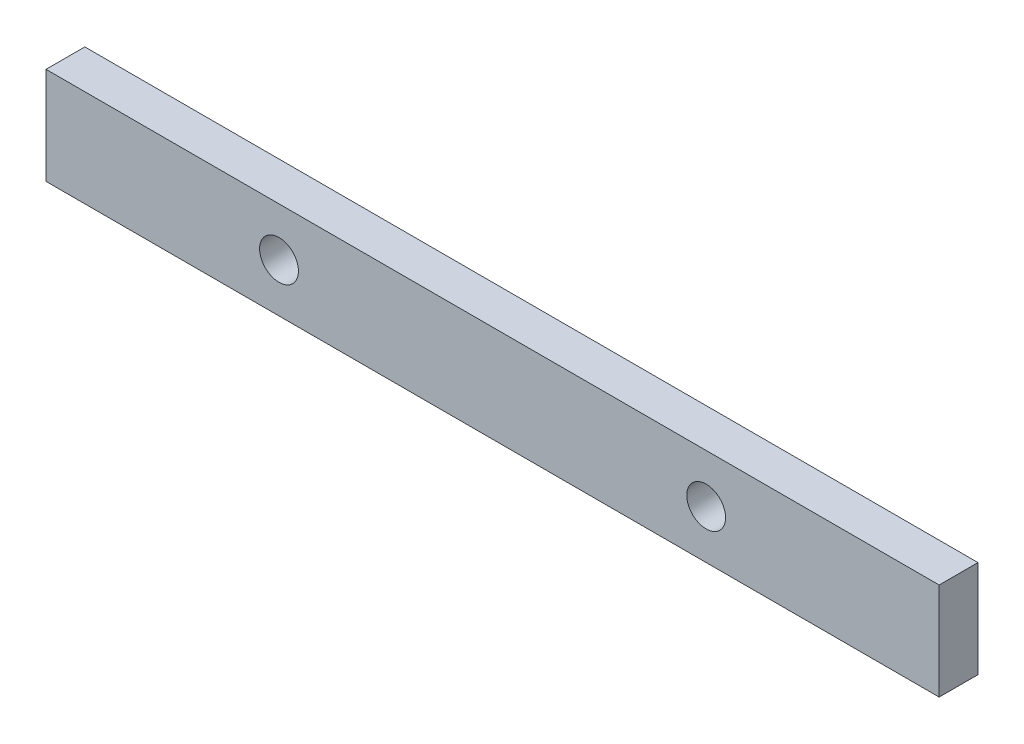
ISO-10303-21;
HEADER;
FILE_DESCRIPTION(('STEP AP214'),'2;1');
FILE_NAME('part.step','',(''),(''),'','','');
FILE_SCHEMA(('AUTOMOTIVE_DESIGN { 1 0 10303 214 1 1 1 1 }'));
ENDSEC;
DATA;
#1=APPLICATION_CONTEXT('core data for automotive mechanical design processes');
#2=APPLICATION_PROTOCOL_DEFINITION('international standard','automotive_design',2000,#1);
#3=PRODUCT_CONTEXT('',#1,'mechanical');
#4=PRODUCT('Part','Part','',(#3));
#5=PRODUCT_RELATED_PRODUCT_CATEGORY('part','',(#4));
#6=PRODUCT_DEFINITION_FORMATION('','',#4);
#7=PRODUCT_DEFINITION_CONTEXT('part definition',#1,'design');
#8=PRODUCT_DEFINITION('design','',#6,#7);
#9=PRODUCT_DEFINITION_SHAPE('','',#8);
#10=(LENGTH_UNIT() NAMED_UNIT(*) SI_UNIT(.MILLI.,.METRE.));
#11=(NAMED_UNIT(*) PLANE_ANGLE_UNIT() SI_UNIT($,.RADIAN.));
#12=(NAMED_UNIT(*) SI_UNIT($,.STERADIAN.) SOLID_ANGLE_UNIT());
#13=UNCERTAINTY_MEASURE_WITH_UNIT(LENGTH_MEASURE(1.E-05),#10,'distance_accuracy_value','');
#14=(GEOMETRIC_REPRESENTATION_CONTEXT(3) GLOBAL_UNCERTAINTY_ASSIGNED_CONTEXT((#13)) GLOBAL_UNIT_ASSIGNED_CONTEXT((#10,
#11,#12)) REPRESENTATION_CONTEXT('',''));
#15=CARTESIAN_POINT('',(0.,0.,0.));
#16=DIRECTION('',(0.,0.,1.));
#17=DIRECTION('',(1.,0.,0.));
#18=AXIS2_PLACEMENT_3D('',#15,#16,#17);
#19=CARTESIAN_POINT('',(0.,0.,20.));
#20=DIRECTION('',(0.,0.,1.));
#21=DIRECTION('',(1.,0.,0.));
#22=AXIS2_PLACEMENT_3D('',#19,#20,#21);
#23=PLANE('',#22);
#24=CARTESIAN_POINT('',(110.,0.,20.));
#25=DIRECTION('',(0.,0.,1.));
#26=DIRECTION('',(1.,0.,0.));
#27=AXIS2_PLACEMENT_3D('',#24,#25,#26);
#28=CIRCLE('',#27,9.99999999999999);
#29=CARTESIAN_POINT('',(120.,0.,20.));
#30=VERTEX_POINT('',#29);
#31=EDGE_CURVE('E112',#30,#30,#28,.T.);
#32=ORIENTED_EDGE('',*,*,#31,.F.);
#33=EDGE_LOOP('',(#32));
#34=FACE_BOUND('',#33,.T.);
#35=DIRECTION('',(0.,1.,0.));
#36=VECTOR('',#35,1.);
#37=CARTESIAN_POINT('',(230.,25.,20.));
#38=LINE('',#37,#36);
#39=CARTESIAN_POINT('',(230.,-25.,20.));
#40=VERTEX_POINT('',#39);
#41=CARTESIAN_POINT('',(230.,25.,20.));
#42=VERTEX_POINT('',#41);
#43=EDGE_CURVE('E92',#40,#42,#38,.T.);
#44=ORIENTED_EDGE('',*,*,#43,.T.);
#45=DIRECTION('',(-1.,0.,0.));
#46=VECTOR('',#45,1.);
#47=CARTESIAN_POINT('',(-230.,25.,20.));
#48=LINE('',#47,#46);
#49=CARTESIAN_POINT('',(-230.,25.,20.));
#50=VERTEX_POINT('',#49);
#51=EDGE_CURVE('E87',#42,#50,#48,.T.);
#52=ORIENTED_EDGE('',*,*,#51,.T.);
#53=DIRECTION('',(0.,-1.,0.));
#54=VECTOR('',#53,1.);
#55=CARTESIAN_POINT('',(-230.,25.,20.));
#56=LINE('',#55,#54);
#57=CARTESIAN_POINT('',(-230.,-25.,20.));
#58=VERTEX_POINT('',#57);
#59=EDGE_CURVE('E90',#50,#58,#56,.T.);
#60=ORIENTED_EDGE('',*,*,#59,.T.);
#61=DIRECTION('',(1.,0.,0.));
#62=VECTOR('',#61,1.);
#63=CARTESIAN_POINT('',(-230.,-25.,20.));
#64=LINE('',#63,#62);
#65=EDGE_CURVE('E57',#58,#40,#64,.T.);
#66=ORIENTED_EDGE('',*,*,#65,.T.);
#67=EDGE_LOOP('',(#44,#52,#60,#66));
#68=FACE_BOUND('',#67,.T.);
#69=CARTESIAN_POINT('',(-110.,0.,20.));
#70=DIRECTION('',(0.,0.,1.));
#71=DIRECTION('',(1.,0.,0.));
#72=AXIS2_PLACEMENT_3D('',#69,#70,#71);
#73=CIRCLE('',#72,9.99999999999999);
#74=CARTESIAN_POINT('',(-100.,0.,20.));
#75=VERTEX_POINT('',#74);
#76=EDGE_CURVE('E134',#75,#75,#73,.T.);
#77=ORIENTED_EDGE('',*,*,#76,.F.);
#78=EDGE_LOOP('',(#77));
#79=FACE_BOUND('',#78,.T.);
#80=ADVANCED_FACE('F39',(#34,#68,#79),#23,.T.);
#81=CARTESIAN_POINT('',(0.,0.,0.));
#82=DIRECTION('',(0.,0.,1.));
#83=DIRECTION('',(1.,0.,0.));
#84=AXIS2_PLACEMENT_3D('',#81,#82,#83);
#85=PLANE('',#84);
#86=DIRECTION('',(0.,1.,0.));
#87=VECTOR('',#86,1.);
#88=CARTESIAN_POINT('',(230.,25.,0.));
#89=LINE('',#88,#87);
#90=CARTESIAN_POINT('',(230.,-25.,0.));
#91=VERTEX_POINT('',#90);
#92=CARTESIAN_POINT('',(230.,25.,0.));
#93=VERTEX_POINT('',#92);
#94=EDGE_CURVE('E108',#91,#93,#89,.T.);
#95=ORIENTED_EDGE('',*,*,#94,.F.);
#96=DIRECTION('',(1.,0.,0.));
#97=VECTOR('',#96,1.);
#98=CARTESIAN_POINT('',(-230.,-25.,0.));
#99=LINE('',#98,#97);
#100=CARTESIAN_POINT('',(-230.,-25.,0.));
#101=VERTEX_POINT('',#100);
#102=EDGE_CURVE('E80',#101,#91,#99,.T.);
#103=ORIENTED_EDGE('',*,*,#102,.F.);
#104=DIRECTION('',(0.,-1.,0.));
#105=VECTOR('',#104,1.);
#106=CARTESIAN_POINT('',(-230.,25.,0.));
#107=LINE('',#106,#105);
#108=CARTESIAN_POINT('',(-230.,25.,0.));
#109=VERTEX_POINT('',#108);
#110=EDGE_CURVE('E74',#109,#101,#107,.T.);
#111=ORIENTED_EDGE('',*,*,#110,.F.);
#112=DIRECTION('',(-1.,0.,0.));
#113=VECTOR('',#112,1.);
#114=CARTESIAN_POINT('',(-230.,25.,0.));
#115=LINE('',#114,#113);
#116=EDGE_CURVE('E97',#93,#109,#115,.T.);
#117=ORIENTED_EDGE('',*,*,#116,.F.);
#118=EDGE_LOOP('',(#95,#103,#111,#117));
#119=FACE_BOUND('',#118,.T.);
#120=CARTESIAN_POINT('',(110.,0.,0.));
#121=DIRECTION('',(0.,0.,1.));
#122=DIRECTION('',(1.,0.,0.));
#123=AXIS2_PLACEMENT_3D('',#120,#121,#122);
#124=CIRCLE('',#123,9.99999999999999);
#125=CARTESIAN_POINT('',(120.,0.,0.));
#126=VERTEX_POINT('',#125);
#127=EDGE_CURVE('E130',#126,#126,#124,.T.);
#128=ORIENTED_EDGE('',*,*,#127,.T.);
#129=EDGE_LOOP('',(#128));
#130=FACE_BOUND('',#129,.T.);
#131=CARTESIAN_POINT('',(-110.,0.,0.));
#132=DIRECTION('',(0.,0.,1.));
#133=DIRECTION('',(1.,0.,0.));
#134=AXIS2_PLACEMENT_3D('',#131,#132,#133);
#135=CIRCLE('',#134,9.99999999999999);
#136=CARTESIAN_POINT('',(-100.,0.,0.));
#137=VERTEX_POINT('',#136);
#138=EDGE_CURVE('E138',#137,#137,#135,.T.);
#139=ORIENTED_EDGE('',*,*,#138,.T.);
#140=EDGE_LOOP('',(#139));
#141=FACE_BOUND('',#140,.T.);
#142=ADVANCED_FACE('F125',(#119,#130,#141),#85,.F.);
#143=CARTESIAN_POINT('',(230.,25.,20.));
#144=DIRECTION('',(-1.,0.,0.));
#145=DIRECTION('',(0.,0.,1.));
#146=AXIS2_PLACEMENT_3D('',#143,#144,#145);
#147=PLANE('',#146);
#148=ORIENTED_EDGE('',*,*,#94,.T.);
#149=DIRECTION('',(0.,0.,-1.));
#150=VECTOR('',#149,1.);
#151=CARTESIAN_POINT('',(230.,25.,20.));
#152=LINE('',#151,#150);
#153=EDGE_CURVE('E11',#42,#93,#152,.T.);
#154=ORIENTED_EDGE('',*,*,#153,.F.);
#155=ORIENTED_EDGE('',*,*,#43,.F.);
#156=DIRECTION('',(0.,0.,-1.));
#157=VECTOR('',#156,1.);
#158=CARTESIAN_POINT('',(230.,-25.,20.));
#159=LINE('',#158,#157);
#160=EDGE_CURVE('E104',#40,#91,#159,.T.);
#161=ORIENTED_EDGE('',*,*,#160,.T.);
#162=EDGE_LOOP('',(#148,#154,#155,#161));
#163=FACE_BOUND('',#162,.T.);
#164=ADVANCED_FACE('F41',(#163),#147,.F.);
#165=CARTESIAN_POINT('',(-230.,25.,20.));
#166=DIRECTION('',(0.,-1.,0.));
#167=DIRECTION('',(0.,0.,-1.));
#168=AXIS2_PLACEMENT_3D('',#165,#166,#167);
#169=PLANE('',#168);
#170=ORIENTED_EDGE('',*,*,#116,.T.);
#171=DIRECTION('',(0.,0.,-1.));
#172=VECTOR('',#171,1.);
#173=CARTESIAN_POINT('',(-230.,25.,20.));
#174=LINE('',#173,#172);
#175=EDGE_CURVE('E49',#50,#109,#174,.T.);
#176=ORIENTED_EDGE('',*,*,#175,.F.);
#177=ORIENTED_EDGE('',*,*,#51,.F.);
#178=ORIENTED_EDGE('',*,*,#153,.T.);
#179=EDGE_LOOP('',(#170,#176,#177,#178));
#180=FACE_BOUND('',#179,.T.);
#181=ADVANCED_FACE('F96',(#180),#169,.F.);
#182=CARTESIAN_POINT('',(-230.,25.,20.));
#183=DIRECTION('',(1.,0.,0.));
#184=DIRECTION('',(0.,0.,-1.));
#185=AXIS2_PLACEMENT_3D('',#182,#183,#184);
#186=PLANE('',#185);
#187=ORIENTED_EDGE('',*,*,#110,.T.);
#188=DIRECTION('',(0.,0.,-1.));
#189=VECTOR('',#188,1.);
#190=CARTESIAN_POINT('',(-230.,-25.,20.));
#191=LINE('',#190,#189);
#192=EDGE_CURVE('E99',#58,#101,#191,.T.);
#193=ORIENTED_EDGE('',*,*,#192,.F.);
#194=ORIENTED_EDGE('',*,*,#59,.F.);
#195=ORIENTED_EDGE('',*,*,#175,.T.);
#196=EDGE_LOOP('',(#187,#193,#194,#195));
#197=FACE_BOUND('',#196,.T.);
#198=ADVANCED_FACE('F100',(#197),#186,.F.);
#199=CARTESIAN_POINT('',(-230.,-25.,20.));
#200=DIRECTION('',(0.,1.,0.));
#201=DIRECTION('',(0.,0.,1.));
#202=AXIS2_PLACEMENT_3D('',#199,#200,#201);
#203=PLANE('',#202);
#204=ORIENTED_EDGE('',*,*,#102,.T.);
#205=ORIENTED_EDGE('',*,*,#160,.F.);
#206=ORIENTED_EDGE('',*,*,#65,.F.);
#207=ORIENTED_EDGE('',*,*,#192,.T.);
#208=EDGE_LOOP('',(#204,#205,#206,#207));
#209=FACE_BOUND('',#208,.T.);
#210=ADVANCED_FACE('F122',(#209),#203,.F.);
#211=CARTESIAN_POINT('',(110.,0.,20.));
#212=DIRECTION('',(0.,0.,-1.));
#213=DIRECTION('',(-1.,0.,0.));
#214=AXIS2_PLACEMENT_3D('',#211,#212,#213);
#215=CYLINDRICAL_SURFACE('',#214,9.99999999999999);
#216=ORIENTED_EDGE('',*,*,#31,.T.);
#217=EDGE_LOOP('',(#216));
#218=FACE_BOUND('',#217,.T.);
#219=ORIENTED_EDGE('',*,*,#127,.F.);
#220=EDGE_LOOP('',(#219));
#221=FACE_BOUND('',#220,.T.);
#222=ADVANCED_FACE('F157',(#218,#221),#215,.F.);
#223=CARTESIAN_POINT('',(-110.,0.,20.));
#224=DIRECTION('',(0.,0.,-1.));
#225=DIRECTION('',(-1.,0.,0.));
#226=AXIS2_PLACEMENT_3D('',#223,#224,#225);
#227=CYLINDRICAL_SURFACE('',#226,9.99999999999999);
#228=ORIENTED_EDGE('',*,*,#76,.T.);
#229=EDGE_LOOP('',(#228));
#230=FACE_BOUND('',#229,.T.);
#231=ORIENTED_EDGE('',*,*,#138,.F.);
#232=EDGE_LOOP('',(#231));
#233=FACE_BOUND('',#232,.T.);
#234=ADVANCED_FACE('F146',(#230,#233),#227,.F.);
#235=CLOSED_SHELL('',(#80,#142,#164,#181,#198,#210,#222,#234));
#236=MANIFOLD_SOLID_BREP('B2',#235);
#237=ADVANCED_BREP_SHAPE_REPRESENTATION('',(#18,#236),#14);
#238=SHAPE_DEFINITION_REPRESENTATION(#9,#237);
ENDSEC;
END-ISO-10303-21;
